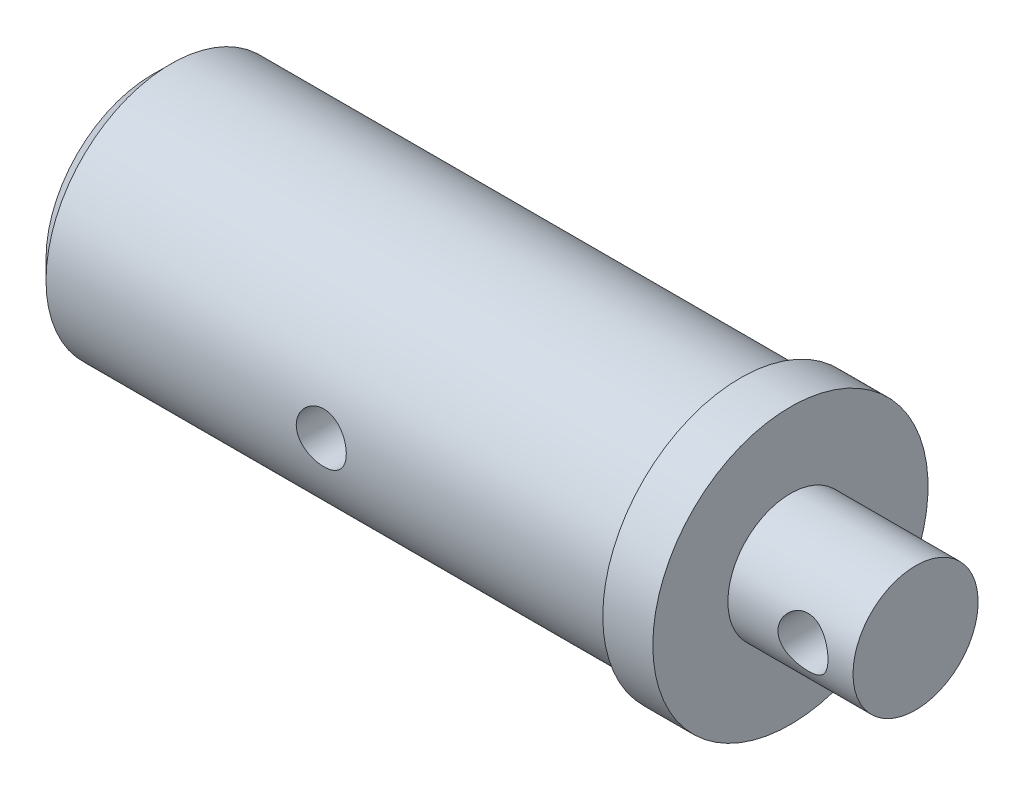
ISO-10303-21;
HEADER;
FILE_DESCRIPTION(('STEP AP214'),'2;1');
FILE_NAME('part.step','',(''),(''),'','','');
FILE_SCHEMA(('AUTOMOTIVE_DESIGN { 1 0 10303 214 1 1 1 1 }'));
ENDSEC;
DATA;
#1=APPLICATION_CONTEXT('core data for automotive mechanical design processes');
#2=APPLICATION_PROTOCOL_DEFINITION('international standard','automotive_design',2000,#1);
#3=PRODUCT_CONTEXT('',#1,'mechanical');
#4=PRODUCT('Part','Part','',(#3));
#5=PRODUCT_RELATED_PRODUCT_CATEGORY('part','',(#4));
#6=PRODUCT_DEFINITION_FORMATION('','',#4);
#7=PRODUCT_DEFINITION_CONTEXT('part definition',#1,'design');
#8=PRODUCT_DEFINITION('design','',#6,#7);
#9=PRODUCT_DEFINITION_SHAPE('','',#8);
#10=(LENGTH_UNIT() NAMED_UNIT(*) SI_UNIT(.MILLI.,.METRE.));
#11=(NAMED_UNIT(*) PLANE_ANGLE_UNIT() SI_UNIT($,.RADIAN.));
#12=(NAMED_UNIT(*) SI_UNIT($,.STERADIAN.) SOLID_ANGLE_UNIT());
#13=UNCERTAINTY_MEASURE_WITH_UNIT(LENGTH_MEASURE(1.E-05),#10,'distance_accuracy_value','');
#14=(GEOMETRIC_REPRESENTATION_CONTEXT(3) GLOBAL_UNCERTAINTY_ASSIGNED_CONTEXT((#13)) GLOBAL_UNIT_ASSIGNED_CONTEXT((#10,
#11,#12)) REPRESENTATION_CONTEXT('',''));
#15=CARTESIAN_POINT('',(0.,0.,0.));
#16=DIRECTION('',(0.,0.,1.));
#17=DIRECTION('',(1.,0.,0.));
#18=AXIS2_PLACEMENT_3D('',#15,#16,#17);
#19=CARTESIAN_POINT('',(-22.,0.,-10.));
#20=DIRECTION('',(1.,0.,0.));
#21=DIRECTION('',(0.,0.,-1.));
#22=AXIS2_PLACEMENT_3D('',#19,#20,#21);
#23=PLANE('',#22);
#24=CARTESIAN_POINT('',(-22.,0.,0.));
#25=DIRECTION('',(1.,0.,0.));
#26=DIRECTION('',(0.,0.,-1.));
#27=AXIS2_PLACEMENT_3D('',#24,#25,#26);
#28=CIRCLE('',#27,8.5);
#29=CARTESIAN_POINT('',(-22.,0.,-8.5));
#30=VERTEX_POINT('',#29);
#31=EDGE_CURVE('E64',#30,#30,#28,.F.);
#32=ORIENTED_EDGE('',*,*,#31,.T.);
#33=EDGE_LOOP('',(#32));
#34=FACE_BOUND('',#33,.T.);
#35=CARTESIAN_POINT('',(-22.,0.,0.));
#36=DIRECTION('',(-1.,0.,0.));
#37=DIRECTION('',(0.,0.,1.));
#38=AXIS2_PLACEMENT_3D('',#35,#36,#37);
#39=CIRCLE('',#38,6.);
#40=CARTESIAN_POINT('',(-22.,0.,6.));
#41=VERTEX_POINT('',#40);
#42=EDGE_CURVE('E144',#41,#41,#39,.T.);
#43=ORIENTED_EDGE('',*,*,#42,.F.);
#44=EDGE_LOOP('',(#43));
#45=FACE_BOUND('',#44,.T.);
#46=ADVANCED_FACE('F51',(#34,#45),#23,.F.);
#47=CARTESIAN_POINT('',(39.,0.,0.));
#48=DIRECTION('',(-1.,0.,0.));
#49=DIRECTION('',(0.,0.,1.));
#50=AXIS2_PLACEMENT_3D('',#47,#48,#49);
#51=PLANE('',#50);
#52=CARTESIAN_POINT('',(39.,0.,0.));
#53=DIRECTION('',(-1.,0.,0.));
#54=DIRECTION('',(0.,0.,1.));
#55=AXIS2_PLACEMENT_3D('',#52,#53,#54);
#56=CIRCLE('',#55,5.);
#57=CARTESIAN_POINT('',(39.,0.,5.));
#58=VERTEX_POINT('',#57);
#59=EDGE_CURVE('E69',#58,#58,#56,.T.);
#60=ORIENTED_EDGE('',*,*,#59,.F.);
#61=EDGE_LOOP('',(#60));
#62=FACE_BOUND('',#61,.T.);
#63=ADVANCED_FACE('F133',(#62),#51,.F.);
#64=CARTESIAN_POINT('',(-22.,0.,0.));
#65=DIRECTION('',(-1.,0.,0.));
#66=DIRECTION('',(0.,0.,1.));
#67=AXIS2_PLACEMENT_3D('',#64,#65,#66);
#68=CYLINDRICAL_SURFACE('',#67,5.);
#69=CARTESIAN_POINT('',(37.,0.,5.));
#70=CARTESIAN_POINT('',(36.9999901481763,-0.107493005442892,4.99999271227085));
#71=CARTESIAN_POINT('',(36.9912822479116,-0.215172564090673,4.99649294306932));
#72=CARTESIAN_POINT('',(36.9567522964788,-0.427496480417896,4.98283453100641));
#73=CARTESIAN_POINT('',(36.9308837209139,-0.532131777561249,4.97265778698877));
#74=CARTESIAN_POINT('',(36.8631239219412,-0.734953922727403,4.94674209213119));
#75=CARTESIAN_POINT('',(36.8212851537833,-0.833160661616958,4.93102136364072));
#76=CARTESIAN_POINT('',(36.7229808266735,-1.02107197032837,4.89556610796078));
#77=CARTESIAN_POINT('',(36.6665203450811,-1.11077947675099,4.87583297458057));
#78=CARTESIAN_POINT('',(36.5377645014391,-1.28350100757039,4.83330886170419));
#79=CARTESIAN_POINT('',(36.4648933437597,-1.36606227255021,4.81042296929191));
#80=CARTESIAN_POINT('',(36.3065999965232,-1.51817500478472,4.76460576906195));
#81=CARTESIAN_POINT('',(36.2211717027883,-1.58772010713353,4.74167444453792));
#82=CARTESIAN_POINT('',(36.0355719297577,-1.71487456729288,4.69722791797136));
#83=CARTESIAN_POINT('',(35.9349135139768,-1.77181498119547,4.67582115964951));
#84=CARTESIAN_POINT('',(35.72446360158,-1.86775471903715,4.63833647186793));
#85=CARTESIAN_POINT('',(35.6146764721516,-1.90676256428584,4.62225601244176));
#86=CARTESIAN_POINT('',(35.3942876664079,-1.96389882339587,4.59826357660818));
#87=CARTESIAN_POINT('',(35.2839487644238,-1.98289396580565,4.59001420355605));
#88=CARTESIAN_POINT('',(35.0613650016927,-2.00217296164003,4.58164004049144));
#89=CARTESIAN_POINT('',(34.949121105375,-2.00246601631323,4.58151125522768));
#90=CARTESIAN_POINT('',(34.734243328542,-1.98498936750455,4.58910500279994));
#91=CARTESIAN_POINT('',(34.631484285591,-1.96847531430514,4.5962817503845));
#92=CARTESIAN_POINT('',(34.4303404439933,-1.91994688029782,4.61676187607836));
#93=CARTESIAN_POINT('',(34.3319564118897,-1.88792979480463,4.63006632321673));
#94=CARTESIAN_POINT('',(34.139982163804,-1.80869473255108,4.6615948508853));
#95=CARTESIAN_POINT('',(34.0465307609453,-1.76117986231532,4.67991379280788));
#96=CARTESIAN_POINT('',(33.8685841836384,-1.65250646073222,4.7193811638989));
#97=CARTESIAN_POINT('',(33.7840923905972,-1.59134280510085,4.74053065456848));
#98=CARTESIAN_POINT('',(33.619590271198,-1.45155059945444,4.78526736742271));
#99=CARTESIAN_POINT('',(33.540431270554,-1.37193746297064,4.80891664976152));
#100=CARTESIAN_POINT('',(33.396315521998,-1.20031442743019,4.85459824958282));
#101=CARTESIAN_POINT('',(33.3313616025897,-1.10830206533444,4.87663024445325));
#102=CARTESIAN_POINT('',(33.2163825525842,-0.912077652605845,4.91714681264548));
#103=CARTESIAN_POINT('',(33.1666777188029,-0.80766049134648,4.93555270095415));
#104=CARTESIAN_POINT('',(33.0858321389219,-0.591023765482884,4.96614828328759));
#105=CARTESIAN_POINT('',(33.0546819624426,-0.478808196849676,4.97834113462382));
#106=CARTESIAN_POINT('',(33.0135517045803,-0.256895887607822,4.99456139506911));
#107=CARTESIAN_POINT('',(33.0024275457464,-0.147443293985536,4.99902945833514));
#108=CARTESIAN_POINT('',(32.9982868994714,0.071845309807816,5.00068478510631));
#109=CARTESIAN_POINT('',(33.0052657184525,0.181681213223923,4.99787393582291));
#110=CARTESIAN_POINT('',(33.036291752552,0.393432739121988,4.98557567063753));
#111=CARTESIAN_POINT('',(33.059557980351,0.495482491775476,4.97639391345523));
#112=CARTESIAN_POINT('',(33.1214357083098,0.694135428060782,4.952594414055));
#113=CARTESIAN_POINT('',(33.1600491796687,0.790737910224845,4.9379759735653));
#114=CARTESIAN_POINT('',(33.2527849396799,0.979078785816701,4.90416594770812));
#115=CARTESIAN_POINT('',(33.3073454720431,1.0705780227554,4.88484815979804));
#116=CARTESIAN_POINT('',(33.4299403239056,1.24344359124655,4.84373364745525));
#117=CARTESIAN_POINT('',(33.4979800429226,1.32480584076112,4.82193593110271));
#118=CARTESIAN_POINT('',(33.6508700129496,1.48072304302882,4.77645117638112));
#119=CARTESIAN_POINT('',(33.7365335415062,1.55447393380607,4.75273441425052));
#120=CARTESIAN_POINT('',(33.9194400830094,1.68675119741371,4.70741672917132));
#121=CARTESIAN_POINT('',(34.0166850003399,1.74527506133751,4.68581615526511));
#122=CARTESIAN_POINT('',(34.2214616945941,1.84580750193163,4.64714299907708));
#123=CARTESIAN_POINT('',(34.3290839992123,1.88765059453446,4.63011630884788));
#124=CARTESIAN_POINT('',(34.5507336517151,1.95229621970531,4.60323673477931));
#125=CARTESIAN_POINT('',(34.6647562058124,1.97511280526932,4.59337855695998));
#126=CARTESIAN_POINT('',(34.8871279017745,1.9997156172784,4.58271759299926));
#127=CARTESIAN_POINT('',(34.9952948395933,2.00289708230287,4.58131421008171));
#128=CARTESIAN_POINT('',(35.2105448577133,1.99180315927753,4.58614836033098));
#129=CARTESIAN_POINT('',(35.3176280739026,1.97752998791379,4.59238492324793));
#130=CARTESIAN_POINT('',(35.523332189855,1.93307136615365,4.61126649079021));
#131=CARTESIAN_POINT('',(35.622120274433,1.90353749357098,4.62364831827449));
#132=CARTESIAN_POINT('',(35.8133786296135,1.83000544849101,4.65324001232697));
#133=CARTESIAN_POINT('',(35.9058471468998,1.78600328139381,4.67045121206007));
#134=CARTESIAN_POINT('',(36.0876096192708,1.68187276275973,4.70898609604491));
#135=CARTESIAN_POINT('',(36.1764186701305,1.62096533515949,4.73048882313242));
#136=CARTESIAN_POINT('',(36.3429933172038,1.4858921192715,4.77463804372237));
#137=CARTESIAN_POINT('',(36.4207555721283,1.41172233481812,4.79728488048406));
#138=CARTESIAN_POINT('',(36.5682028532636,1.24650550627247,4.84293567087394));
#139=CARTESIAN_POINT('',(36.6370373068981,1.15467600114614,4.86586757962185));
#140=CARTESIAN_POINT('',(36.7583370426216,0.95990032028578,4.90800406713717));
#141=CARTESIAN_POINT('',(36.8107947121525,0.856949004547236,4.92720691092906));
#142=CARTESIAN_POINT('',(36.8966222151903,0.6447380624952,4.95939714815861));
#143=CARTESIAN_POINT('',(36.9303293235603,0.535631618219694,4.97249363055028));
#144=CARTESIAN_POINT('',(36.9786391209543,0.312876546281221,4.99144306209366));
#145=CARTESIAN_POINT('',(36.9933024367439,0.199243525858914,4.99731899495638));
#146=CARTESIAN_POINT('',(36.9993953809783,0.0569122978909313,4.99975899504136));
#147=CARTESIAN_POINT('',(37.0000026086292,0.0284626887407592,5.00000192969176));
#148=CARTESIAN_POINT('',(37.,0.,5.));
#149=B_SPLINE_CURVE_WITH_KNOTS('',3,(#69,#70,#71,#72,#73,#74,#75,#76,#77,#78,#79,#80,#81,#82,
#83,#84,#85,#86,#87,#88,#89,#90,#91,#92,#93,#94,#95,#96,#97,#98,#99,#100,#101,#102,#103,#104,
#105,#106,#107,#108,#109,#110,#111,#112,#113,#114,#115,#116,#117,#118,#119,#120,#121,#122,#123,
#124,#125,#126,#127,#128,#129,#130,#131,#132,#133,#134,#135,#136,#137,#138,#139,#140,#141,#142,
#143,#144,#145,#146,#147,#148),.UNSPECIFIED.,.T.,.F.,(4,2,2,2,2,2,2,2,2,2,2,2,2,2,2,2,2,2,2,2,2,
2,2,2,2,2,2,2,2,2,2,2,2,2,2,2,2,2,2,4),(0.,0.322402987893072,0.645683636007934,
0.967911457471579,1.29002753567984,1.62597381700397,1.96208394934411,2.31315258819217,
2.66405423118268,2.99904105308829,3.33386306340489,3.64538328401373,3.95695787256048,
4.27489126298817,4.59294421938184,4.93558349186558,5.27829092839733,5.62776913162807,
5.97706956113791,6.30569184528008,6.63422893570083,6.94800455564367,7.26182048993797,
7.58523513398263,7.9087795949897,8.25368474624414,8.59864669043749,8.94695045140829,
9.29499672645935,9.61799673392749,9.94095572563047,10.2511431854877,10.5614163580516,
10.8894546805669,11.2175920134839,11.5670042353384,11.9165786364054,12.2596430101332,
12.6016125240434,12.686980458968),.UNSPECIFIED.);
#150=CARTESIAN_POINT('',(37.,0.,5.));
#151=VERTEX_POINT('',#150);
#152=EDGE_CURVE('E55',#151,#151,#149,.T.);
#153=ORIENTED_EDGE('',*,*,#152,.T.);
#154=EDGE_LOOP('',(#153));
#155=FACE_BOUND('',#154,.T.);
#156=CARTESIAN_POINT('',(37.,0.,-5.));
#157=CARTESIAN_POINT('',(36.9999901481763,0.107493005442892,-4.99999271227085));
#158=CARTESIAN_POINT('',(36.9912822479116,0.215172564090673,-4.99649294306932));
#159=CARTESIAN_POINT('',(36.9567522964788,0.427496480417896,-4.98283453100641));
#160=CARTESIAN_POINT('',(36.9308837209139,0.532131777561249,-4.97265778698877));
#161=CARTESIAN_POINT('',(36.8631239219412,0.734953922727403,-4.94674209213119));
#162=CARTESIAN_POINT('',(36.8212851537833,0.833160661616958,-4.93102136364072));
#163=CARTESIAN_POINT('',(36.7229808266735,1.02107197032837,-4.89556610796078));
#164=CARTESIAN_POINT('',(36.6665203450811,1.11077947675099,-4.87583297458057));
#165=CARTESIAN_POINT('',(36.5377645014391,1.28350100757039,-4.83330886170419));
#166=CARTESIAN_POINT('',(36.4648933437597,1.36606227255021,-4.81042296929191));
#167=CARTESIAN_POINT('',(36.3065999965232,1.51817500478472,-4.76460576906195));
#168=CARTESIAN_POINT('',(36.2211717027883,1.58772010713353,-4.74167444453792));
#169=CARTESIAN_POINT('',(36.0355719297577,1.71487456729288,-4.69722791797136));
#170=CARTESIAN_POINT('',(35.9349135139768,1.77181498119547,-4.67582115964951));
#171=CARTESIAN_POINT('',(35.72446360158,1.86775471903715,-4.63833647186793));
#172=CARTESIAN_POINT('',(35.6146764721516,1.90676256428584,-4.62225601244176));
#173=CARTESIAN_POINT('',(35.3942876664079,1.96389882339587,-4.59826357660818));
#174=CARTESIAN_POINT('',(35.2839487644238,1.98289396580565,-4.59001420355605));
#175=CARTESIAN_POINT('',(35.0613650016927,2.00217296164003,-4.58164004049144));
#176=CARTESIAN_POINT('',(34.949121105375,2.00246601631323,-4.58151125522768));
#177=CARTESIAN_POINT('',(34.734243328542,1.98498936750455,-4.58910500279994));
#178=CARTESIAN_POINT('',(34.631484285591,1.96847531430514,-4.5962817503845));
#179=CARTESIAN_POINT('',(34.4303404439933,1.91994688029782,-4.61676187607836));
#180=CARTESIAN_POINT('',(34.3319564118897,1.88792979480463,-4.63006632321673));
#181=CARTESIAN_POINT('',(34.139982163804,1.80869473255108,-4.6615948508853));
#182=CARTESIAN_POINT('',(34.0465307609453,1.76117986231532,-4.67991379280788));
#183=CARTESIAN_POINT('',(33.8685841836384,1.65250646073222,-4.7193811638989));
#184=CARTESIAN_POINT('',(33.7840923905972,1.59134280510085,-4.74053065456848));
#185=CARTESIAN_POINT('',(33.619590271198,1.45155059945444,-4.78526736742271));
#186=CARTESIAN_POINT('',(33.540431270554,1.37193746297064,-4.80891664976152));
#187=CARTESIAN_POINT('',(33.396315521998,1.20031442743019,-4.85459824958282));
#188=CARTESIAN_POINT('',(33.3313616025897,1.10830206533444,-4.87663024445325));
#189=CARTESIAN_POINT('',(33.2163825525842,0.912077652605845,-4.91714681264548));
#190=CARTESIAN_POINT('',(33.1666777188029,0.80766049134648,-4.93555270095415));
#191=CARTESIAN_POINT('',(33.0858321389219,0.591023765482884,-4.96614828328759));
#192=CARTESIAN_POINT('',(33.0546819624426,0.478808196849676,-4.97834113462382));
#193=CARTESIAN_POINT('',(33.0135517045803,0.256895887607822,-4.99456139506911));
#194=CARTESIAN_POINT('',(33.0024275457464,0.147443293985536,-4.99902945833514));
#195=CARTESIAN_POINT('',(32.9982868994714,-0.071845309807816,-5.00068478510631));
#196=CARTESIAN_POINT('',(33.0052657184525,-0.181681213223923,-4.99787393582291));
#197=CARTESIAN_POINT('',(33.036291752552,-0.393432739121988,-4.98557567063753));
#198=CARTESIAN_POINT('',(33.059557980351,-0.495482491775476,-4.97639391345523));
#199=CARTESIAN_POINT('',(33.1214357083098,-0.694135428060782,-4.952594414055));
#200=CARTESIAN_POINT('',(33.1600491796687,-0.790737910224845,-4.9379759735653));
#201=CARTESIAN_POINT('',(33.2527849396799,-0.979078785816701,-4.90416594770812));
#202=CARTESIAN_POINT('',(33.3073454720431,-1.0705780227554,-4.88484815979804));
#203=CARTESIAN_POINT('',(33.4299403239056,-1.24344359124655,-4.84373364745525));
#204=CARTESIAN_POINT('',(33.4979800429226,-1.32480584076112,-4.82193593110271));
#205=CARTESIAN_POINT('',(33.6508700129496,-1.48072304302882,-4.77645117638112));
#206=CARTESIAN_POINT('',(33.7365335415062,-1.55447393380607,-4.75273441425052));
#207=CARTESIAN_POINT('',(33.9194400830094,-1.68675119741371,-4.70741672917132));
#208=CARTESIAN_POINT('',(34.0166850003399,-1.74527506133751,-4.68581615526511));
#209=CARTESIAN_POINT('',(34.2214616945941,-1.84580750193163,-4.64714299907708));
#210=CARTESIAN_POINT('',(34.3290839992123,-1.88765059453446,-4.63011630884788));
#211=CARTESIAN_POINT('',(34.5507336517151,-1.95229621970531,-4.60323673477931));
#212=CARTESIAN_POINT('',(34.6647562058124,-1.97511280526932,-4.59337855695998));
#213=CARTESIAN_POINT('',(34.8871279017745,-1.9997156172784,-4.58271759299926));
#214=CARTESIAN_POINT('',(34.9952948395933,-2.00289708230287,-4.58131421008171));
#215=CARTESIAN_POINT('',(35.2105448577133,-1.99180315927753,-4.58614836033098));
#216=CARTESIAN_POINT('',(35.3176280739026,-1.97752998791379,-4.59238492324793));
#217=CARTESIAN_POINT('',(35.523332189855,-1.93307136615365,-4.61126649079021));
#218=CARTESIAN_POINT('',(35.622120274433,-1.90353749357098,-4.62364831827449));
#219=CARTESIAN_POINT('',(35.8133786296135,-1.83000544849101,-4.65324001232697));
#220=CARTESIAN_POINT('',(35.9058471468998,-1.78600328139381,-4.67045121206007));
#221=CARTESIAN_POINT('',(36.0876096192708,-1.68187276275973,-4.70898609604491));
#222=CARTESIAN_POINT('',(36.1764186701305,-1.62096533515949,-4.73048882313242));
#223=CARTESIAN_POINT('',(36.3429933172038,-1.4858921192715,-4.77463804372237));
#224=CARTESIAN_POINT('',(36.4207555721283,-1.41172233481812,-4.79728488048406));
#225=CARTESIAN_POINT('',(36.5682028532636,-1.24650550627247,-4.84293567087394));
#226=CARTESIAN_POINT('',(36.6370373068981,-1.15467600114614,-4.86586757962185));
#227=CARTESIAN_POINT('',(36.7583370426216,-0.95990032028578,-4.90800406713717));
#228=CARTESIAN_POINT('',(36.8107947121525,-0.856949004547236,-4.92720691092906));
#229=CARTESIAN_POINT('',(36.8966222151903,-0.6447380624952,-4.95939714815861));
#230=CARTESIAN_POINT('',(36.9303293235603,-0.535631618219694,-4.97249363055028));
#231=CARTESIAN_POINT('',(36.9786391209543,-0.312876546281221,-4.99144306209366));
#232=CARTESIAN_POINT('',(36.9933024367439,-0.199243525858914,-4.99731899495638));
#233=CARTESIAN_POINT('',(36.9993953809783,-0.0569122978909313,-4.99975899504136));
#234=CARTESIAN_POINT('',(37.0000026086292,-0.0284626887407592,-5.00000192969176));
#235=CARTESIAN_POINT('',(37.,0.,-5.));
#236=B_SPLINE_CURVE_WITH_KNOTS('',3,(#156,#157,#158,#159,#160,#161,#162,#163,#164,#165,#166,
#167,#168,#169,#170,#171,#172,#173,#174,#175,#176,#177,#178,#179,#180,#181,#182,#183,#184,#185,
#186,#187,#188,#189,#190,#191,#192,#193,#194,#195,#196,#197,#198,#199,#200,#201,#202,#203,#204,
#205,#206,#207,#208,#209,#210,#211,#212,#213,#214,#215,#216,#217,#218,#219,#220,#221,#222,#223,
#224,#225,#226,#227,#228,#229,#230,#231,#232,#233,#234,#235),.UNSPECIFIED.,.T.,.F.,(4,2,2,2,2,2,
2,2,2,2,2,2,2,2,2,2,2,2,2,2,2,2,2,2,2,2,2,2,2,2,2,2,2,2,2,2,2,2,2,4),(0.,0.322402987893072,
0.645683636007934,0.967911457471579,1.29002753567984,1.62597381700397,1.96208394934411,
2.31315258819217,2.66405423118268,2.99904105308829,3.33386306340489,3.64538328401373,
3.95695787256048,4.27489126298817,4.59294421938184,4.93558349186558,5.27829092839733,
5.62776913162807,5.97706956113791,6.30569184528008,6.63422893570083,6.94800455564367,
7.26182048993797,7.58523513398263,7.9087795949897,8.25368474624414,8.59864669043749,
8.94695045140829,9.29499672645935,9.61799673392749,9.94095572563047,10.2511431854877,
10.5614163580516,10.8894546805669,11.2175920134839,11.5670042353384,11.9165786364054,
12.2596430101332,12.6016125240434,12.686980458968),.UNSPECIFIED.);
#237=CARTESIAN_POINT('',(37.,0.,-5.));
#238=VERTEX_POINT('',#237);
#239=EDGE_CURVE('E136',#238,#238,#236,.T.);
#240=ORIENTED_EDGE('',*,*,#239,.T.);
#241=EDGE_LOOP('',(#240));
#242=FACE_BOUND('',#241,.T.);
#243=CARTESIAN_POINT('',(29.,0.,0.));
#244=DIRECTION('',(-1.,0.,0.));
#245=DIRECTION('',(0.,0.,1.));
#246=AXIS2_PLACEMENT_3D('',#243,#244,#245);
#247=CIRCLE('',#246,5.);
#248=CARTESIAN_POINT('',(29.,0.,5.));
#249=VERTEX_POINT('',#248);
#250=EDGE_CURVE('E165',#249,#249,#247,.T.);
#251=ORIENTED_EDGE('',*,*,#250,.F.);
#252=EDGE_LOOP('',(#251));
#253=FACE_BOUND('',#252,.T.);
#254=ORIENTED_EDGE('',*,*,#59,.T.);
#255=EDGE_LOOP('',(#254));
#256=FACE_BOUND('',#255,.T.);
#257=ADVANCED_FACE('F128',(#155,#242,#253,#256),#68,.T.);
#258=CARTESIAN_POINT('',(29.,0.,-5.));
#259=DIRECTION('',(-1.,0.,0.));
#260=DIRECTION('',(0.,0.,1.));
#261=AXIS2_PLACEMENT_3D('',#258,#259,#260);
#262=PLANE('',#261);
#263=CARTESIAN_POINT('',(29.,0.,0.));
#264=DIRECTION('',(-1.,0.,0.));
#265=DIRECTION('',(0.,0.,1.));
#266=AXIS2_PLACEMENT_3D('',#263,#264,#265);
#267=CIRCLE('',#266,11.);
#268=CARTESIAN_POINT('',(29.,0.,11.));
#269=VERTEX_POINT('',#268);
#270=EDGE_CURVE('E158',#269,#269,#267,.T.);
#271=ORIENTED_EDGE('',*,*,#270,.F.);
#272=EDGE_LOOP('',(#271));
#273=FACE_BOUND('',#272,.T.);
#274=ORIENTED_EDGE('',*,*,#250,.T.);
#275=EDGE_LOOP('',(#274));
#276=FACE_BOUND('',#275,.T.);
#277=ADVANCED_FACE('F125',(#273,#276),#262,.F.);
#278=CARTESIAN_POINT('',(-22.,0.,0.));
#279=DIRECTION('',(-1.,0.,0.));
#280=DIRECTION('',(0.,0.,1.));
#281=AXIS2_PLACEMENT_3D('',#278,#279,#280);
#282=CYLINDRICAL_SURFACE('',#281,11.);
#283=CARTESIAN_POINT('',(25.,0.,0.));
#284=DIRECTION('',(-1.,0.,0.));
#285=DIRECTION('',(0.,0.,1.));
#286=AXIS2_PLACEMENT_3D('',#283,#284,#285);
#287=CIRCLE('',#286,11.);
#288=CARTESIAN_POINT('',(25.,0.,11.));
#289=VERTEX_POINT('',#288);
#290=EDGE_CURVE('E154',#289,#289,#287,.T.);
#291=ORIENTED_EDGE('',*,*,#290,.F.);
#292=EDGE_LOOP('',(#291));
#293=FACE_BOUND('',#292,.T.);
#294=ORIENTED_EDGE('',*,*,#270,.T.);
#295=EDGE_LOOP('',(#294));
#296=FACE_BOUND('',#295,.T.);
#297=ADVANCED_FACE('F121',(#293,#296),#282,.T.);
#298=CARTESIAN_POINT('',(25.,0.,-11.));
#299=DIRECTION('',(1.,0.,0.));
#300=DIRECTION('',(0.,0.,-1.));
#301=AXIS2_PLACEMENT_3D('',#298,#299,#300);
#302=PLANE('',#301);
#303=CARTESIAN_POINT('',(25.,0.,0.));
#304=DIRECTION('',(-1.,0.,0.));
#305=DIRECTION('',(0.,0.,1.));
#306=AXIS2_PLACEMENT_3D('',#303,#304,#305);
#307=CIRCLE('',#306,10.);
#308=CARTESIAN_POINT('',(25.,0.,10.));
#309=VERTEX_POINT('',#308);
#310=EDGE_CURVE('E153',#309,#309,#307,.T.);
#311=ORIENTED_EDGE('',*,*,#310,.F.);
#312=EDGE_LOOP('',(#311));
#313=FACE_BOUND('',#312,.T.);
#314=ORIENTED_EDGE('',*,*,#290,.T.);
#315=EDGE_LOOP('',(#314));
#316=FACE_BOUND('',#315,.T.);
#317=ADVANCED_FACE('F116',(#313,#316),#302,.F.);
#318=CARTESIAN_POINT('',(-22.,0.,0.));
#319=DIRECTION('',(-1.,0.,0.));
#320=DIRECTION('',(0.,0.,1.));
#321=AXIS2_PLACEMENT_3D('',#318,#319,#320);
#322=CYLINDRICAL_SURFACE('',#321,10.);
#323=CARTESIAN_POINT('',(3.5,0.,10.));
#324=CARTESIAN_POINT('',(3.49999591100331,-0.111153813585266,9.99999795161742));
#325=CARTESIAN_POINT('',(3.49070231406471,-0.222359320403045,9.99812770356462));
#326=CARTESIAN_POINT('',(3.45380299976951,-0.441627015378038,9.99084731246463));
#327=CARTESIAN_POINT('',(3.42618273439698,-0.549686635082711,9.98543435720372));
#328=CARTESIAN_POINT('',(3.35351745275842,-0.759460610526626,9.97167298556574));
#329=CARTESIAN_POINT('',(3.30848912631063,-0.861180935866268,9.96332738153436));
#330=CARTESIAN_POINT('',(3.20233550497741,-1.05561597772845,9.94460796070629));
#331=CARTESIAN_POINT('',(3.14121116878559,-1.14833123015162,9.93423426471414));
#332=CARTESIAN_POINT('',(3.00372301141714,-1.32338695462973,9.9124433065994));
#333=CARTESIAN_POINT('',(2.9271832892176,-1.40558790231705,9.90101491008695));
#334=CARTESIAN_POINT('',(2.7614151672166,-1.55607351321606,9.87848360905177));
#335=CARTESIAN_POINT('',(2.67218577732977,-1.62435708954085,9.86738073000848));
#336=CARTESIAN_POINT('',(2.48256761397625,-1.74566350669524,9.84664883625231));
#337=CARTESIAN_POINT('',(2.38208471240729,-1.79854187773173,9.83703414729892));
#338=CARTESIAN_POINT('',(2.17343636199185,-1.88661133316062,9.82052536116836));
#339=CARTESIAN_POINT('',(2.06527167330732,-1.92180416487448,9.81363099523924));
#340=CARTESIAN_POINT('',(1.84583127218417,-1.97305059976966,9.80345610504409));
#341=CARTESIAN_POINT('',(1.73461491171555,-1.98934899591756,9.80012940214375));
#342=CARTESIAN_POINT('',(1.51098035727132,-2.00310425545224,9.79732750121254));
#343=CARTESIAN_POINT('',(1.39856228735971,-2.000563045427,9.79785190935682));
#344=CARTESIAN_POINT('',(1.177506423958,-1.97690914620364,9.80265102296369));
#345=CARTESIAN_POINT('',(1.06883718874538,-1.95607708048782,9.80686905717527));
#346=CARTESIAN_POINT('',(0.856567846674001,-1.89687576924611,9.81849092320002));
#347=CARTESIAN_POINT('',(0.752967982161989,-1.85850568620137,9.82589490715558));
#348=CARTESIAN_POINT('',(0.552969476592806,-1.76504956734944,9.84311237000816));
#349=CARTESIAN_POINT('',(0.456624240861661,-1.70985230246423,9.85294179627409));
#350=CARTESIAN_POINT('',(0.274458300054377,-1.58438714914536,9.87389237546124));
#351=CARTESIAN_POINT('',(0.188638806297689,-1.51411752871366,9.88501367676732));
#352=CARTESIAN_POINT('',(0.0283411950861314,-1.35899986912117,9.90754042482924));
#353=CARTESIAN_POINT('',(-0.0459051357182569,-1.2739123224249,9.9189473842181));
#354=CARTESIAN_POINT('',(-0.179107692602445,-1.09237004812403,9.94057697428817));
#355=CARTESIAN_POINT('',(-0.238063722587155,-0.995915174758785,9.95079958977947));
#356=CARTESIAN_POINT('',(-0.339055018451947,-0.794118773757848,9.96893380321774));
#357=CARTESIAN_POINT('',(-0.381063787289071,-0.688763639170606,9.97684177696544));
#358=CARTESIAN_POINT('',(-0.446720948077131,-0.472297952897336,9.98942817975717));
#359=CARTESIAN_POINT('',(-0.470371564147254,-0.361188100144906,9.99410700001063));
#360=CARTESIAN_POINT('',(-0.498312907588553,-0.138358811254308,9.99965343733736));
#361=CARTESIAN_POINT('',(-0.502920839080536,-0.0266806566511594,10.0005834930494));
#362=CARTESIAN_POINT('',(-0.493500282115638,0.195849868385421,9.99870103860205));
#363=CARTESIAN_POINT('',(-0.479472841294808,0.30670228488758,9.99588873882892));
#364=CARTESIAN_POINT('',(-0.433443252912088,0.523411319893075,9.98687664016035));
#365=CARTESIAN_POINT('',(-0.401603863004194,0.6293038966798,9.98070752808413));
#366=CARTESIAN_POINT('',(-0.321032034688382,0.834247254999328,9.96567104122066));
#367=CARTESIAN_POINT('',(-0.272298330646341,0.933297523275073,9.95680346428454));
#368=CARTESIAN_POINT('',(-0.158635018697376,1.12308234737243,9.93719823066589));
#369=CARTESIAN_POINT('',(-0.0935144379221105,1.21370025350437,9.92643900874104));
#370=CARTESIAN_POINT('',(0.0508183824145604,1.38283603823841,9.90429469659765));
#371=CARTESIAN_POINT('',(0.130032132799732,1.46135261786152,9.89290953936776));
#372=CARTESIAN_POINT('',(0.301746703782246,1.60528118154835,9.8705860711393));
#373=CARTESIAN_POINT('',(0.394431488442673,1.67047540489731,9.85965720466609));
#374=CARTESIAN_POINT('',(0.589622722713356,1.78437084010241,9.83968383592389));
#375=CARTESIAN_POINT('',(0.692128779147103,1.8330727118458,9.83063925826685));
#376=CARTESIAN_POINT('',(0.903536492299094,1.91230368316392,9.81553481168766));
#377=CARTESIAN_POINT('',(1.01240168242064,1.9429269995821,9.80945949744373));
#378=CARTESIAN_POINT('',(1.23386690698181,1.98541730325439,9.80094873584051));
#379=CARTESIAN_POINT('',(1.34646645241869,1.99728673645022,9.79851281382223));
#380=CARTESIAN_POINT('',(1.57001772908863,2.00184182173493,9.79758299262759));
#381=CARTESIAN_POINT('',(1.68096229785402,1.99487157614179,9.79901838378602));
#382=CARTESIAN_POINT('',(1.90006329981005,1.96270460820012,9.80551146969228));
#383=CARTESIAN_POINT('',(2.00821975538961,1.9375080322586,9.81056913534339));
#384=CARTESIAN_POINT('',(2.21845542248109,1.86975713699791,9.82370528438317));
#385=CARTESIAN_POINT('',(2.32054872100483,1.82724501343469,9.83177642037661));
#386=CARTESIAN_POINT('',(2.51620744146888,1.72610928920321,9.85003429948341));
#387=CARTESIAN_POINT('',(2.60977214745027,1.66748433754976,9.86022121997788));
#388=CARTESIAN_POINT('',(2.78743114430063,1.53461182957283,9.88177921046451));
#389=CARTESIAN_POINT('',(2.87133753053519,1.46011577447036,9.89316745819399));
#390=CARTESIAN_POINT('',(3.02557241105834,1.29812873802628,9.91572163743909));
#391=CARTESIAN_POINT('',(3.09589778063454,1.21063477430667,9.92688751726369));
#392=CARTESIAN_POINT('',(3.22166928789289,1.02403525817649,9.94787664775943));
#393=CARTESIAN_POINT('',(3.27695200656005,0.92481776885967,9.95768462438493));
#394=CARTESIAN_POINT('',(3.36997224519318,0.718332721881466,9.9747025017));
#395=CARTESIAN_POINT('',(3.40772557906498,0.611072521726253,9.98191474277232));
#396=CARTESIAN_POINT('',(3.45730389608943,0.41964297784756,9.99152745190741));
#397=CARTESIAN_POINT('',(3.47328638741552,0.33656332802757,9.99468606316904));
#398=CARTESIAN_POINT('',(3.49463582471673,0.168999050420135,9.99892308279786));
#399=CARTESIAN_POINT('',(3.50000310901954,0.0845144674972385,10.0000015574631));
#400=CARTESIAN_POINT('',(3.5,0.,10.));
#401=B_SPLINE_CURVE_WITH_KNOTS('',3,(#323,#324,#325,#326,#327,#328,#329,#330,#331,#332,#333,
#334,#335,#336,#337,#338,#339,#340,#341,#342,#343,#344,#345,#346,#347,#348,#349,#350,#351,#352,
#353,#354,#355,#356,#357,#358,#359,#360,#361,#362,#363,#364,#365,#366,#367,#368,#369,#370,#371,
#372,#373,#374,#375,#376,#377,#378,#379,#380,#381,#382,#383,#384,#385,#386,#387,#388,#389,#390,
#391,#392,#393,#394,#395,#396,#397,#398,#399,#400),.UNSPECIFIED.,.T.,.F.,(4,2,2,2,2,2,2,2,2,2,2,
2,2,2,2,2,2,2,2,2,2,2,2,2,2,2,2,2,2,2,2,2,2,2,2,2,2,2,4),(0.,0.333152261322517,
0.666569301382646,0.999667470500683,1.33274580446173,1.66986534022437,2.00701119349473,
2.34722390011845,2.68740298730395,3.02312370207175,3.3588100856245,3.68943454012557,
4.02007478507459,4.35294980407185,4.68586309499341,5.02476504982701,5.36367135079641,
5.70310549708048,6.04249851396072,6.3762147135253,6.70991215315735,7.04060907901447,
7.37133078432045,7.70610132066717,8.0409077669186,8.38081257158452,8.72070377446933,
9.05880762065446,9.3968673666083,9.72879445135403,10.0607188698522,10.3918392250622,
10.7229873516373,11.0597615247829,11.3966130906586,11.7369899335127,12.0770591103504,
12.3303755057979,12.5836838274199),.UNSPECIFIED.);
#402=CARTESIAN_POINT('',(3.5,0.,10.));
#403=VERTEX_POINT('',#402);
#404=EDGE_CURVE('E107',#403,#403,#401,.T.);
#405=ORIENTED_EDGE('',*,*,#404,.T.);
#406=EDGE_LOOP('',(#405));
#407=FACE_BOUND('',#406,.T.);
#408=CARTESIAN_POINT('',(3.5,0.,-10.));
#409=CARTESIAN_POINT('',(3.49999591100331,0.111153813585263,-9.99999795161742));
#410=CARTESIAN_POINT('',(3.49070231406471,0.222359320403042,-9.99812770356462));
#411=CARTESIAN_POINT('',(3.45380299976951,0.441627015378036,-9.99084731246463));
#412=CARTESIAN_POINT('',(3.42618273439698,0.549686635082709,-9.98543435720372));
#413=CARTESIAN_POINT('',(3.35351745275842,0.759460610526623,-9.97167298556574));
#414=CARTESIAN_POINT('',(3.30848912631063,0.861180935866265,-9.96332738153436));
#415=CARTESIAN_POINT('',(3.20233550497741,1.05561597772845,-9.94460796070629));
#416=CARTESIAN_POINT('',(3.14121116878559,1.14833123015162,-9.93423426471414));
#417=CARTESIAN_POINT('',(3.00372301141713,1.32338695462973,-9.9124433065994));
#418=CARTESIAN_POINT('',(2.9271832892176,1.40558790231705,-9.90101491008695));
#419=CARTESIAN_POINT('',(2.7614151672166,1.55607351321605,-9.87848360905177));
#420=CARTESIAN_POINT('',(2.67218577732977,1.62435708954085,-9.86738073000848));
#421=CARTESIAN_POINT('',(2.48256761397625,1.74566350669524,-9.84664883625231));
#422=CARTESIAN_POINT('',(2.38208471240728,1.79854187773173,-9.83703414729892));
#423=CARTESIAN_POINT('',(2.17343636199184,1.88661133316061,-9.82052536116836));
#424=CARTESIAN_POINT('',(2.06527167330731,1.92180416487447,-9.81363099523924));
#425=CARTESIAN_POINT('',(1.84583127218417,1.97305059976965,-9.80345610504409));
#426=CARTESIAN_POINT('',(1.73461491171555,1.98934899591755,-9.80012940214376));
#427=CARTESIAN_POINT('',(1.51098035727132,2.00310425545224,-9.79732750121255));
#428=CARTESIAN_POINT('',(1.39856228735971,2.000563045427,-9.79785190935682));
#429=CARTESIAN_POINT('',(1.177506423958,1.97690914620364,-9.80265102296369));
#430=CARTESIAN_POINT('',(1.06883718874537,1.95607708048781,-9.80686905717528));
#431=CARTESIAN_POINT('',(0.856567846673998,1.8968757692461,-9.81849092320003));
#432=CARTESIAN_POINT('',(0.752967982161986,1.85850568620136,-9.82589490715558));
#433=CARTESIAN_POINT('',(0.552969476592803,1.76504956734944,-9.84311237000816));
#434=CARTESIAN_POINT('',(0.456624240861658,1.70985230246423,-9.85294179627409));
#435=CARTESIAN_POINT('',(0.274458300054374,1.58438714914536,-9.87389237546124));
#436=CARTESIAN_POINT('',(0.188638806297687,1.51411752871366,-9.88501367676732));
#437=CARTESIAN_POINT('',(0.0283411950861293,1.35899986912117,-9.90754042482924));
#438=CARTESIAN_POINT('',(-0.0459051357182589,1.27391232242489,-9.9189473842181));
#439=CARTESIAN_POINT('',(-0.179107692602447,1.09237004812402,-9.94057697428817));
#440=CARTESIAN_POINT('',(-0.238063722587157,0.995915174758776,-9.95079958977947));
#441=CARTESIAN_POINT('',(-0.339055018451949,0.794118773757839,-9.96893380321774));
#442=CARTESIAN_POINT('',(-0.381063787289073,0.688763639170597,-9.97684177696544));
#443=CARTESIAN_POINT('',(-0.446720948077132,0.472297952897327,-9.98942817975717));
#444=CARTESIAN_POINT('',(-0.470371564147255,0.361188100144897,-9.99410700001063));
#445=CARTESIAN_POINT('',(-0.498312907588554,0.138358811254299,-9.99965343733736));
#446=CARTESIAN_POINT('',(-0.502920839080536,0.0266806566511501,-10.0005834930494));
#447=CARTESIAN_POINT('',(-0.493500282115637,-0.195849868385431,-9.99870103860205));
#448=CARTESIAN_POINT('',(-0.479472841294808,-0.306702284887589,-9.99588873882892));
#449=CARTESIAN_POINT('',(-0.433443252912087,-0.523411319893084,-9.98687664016035));
#450=CARTESIAN_POINT('',(-0.401603863004193,-0.629303896679809,-9.98070752808413));
#451=CARTESIAN_POINT('',(-0.321032034688381,-0.834247254999337,-9.96567104122065));
#452=CARTESIAN_POINT('',(-0.272298330646339,-0.933297523275082,-9.95680346428454));
#453=CARTESIAN_POINT('',(-0.158635018697374,-1.12308234737244,-9.93719823066589));
#454=CARTESIAN_POINT('',(-0.0935144379221085,-1.21370025350438,-9.92643900874104));
#455=CARTESIAN_POINT('',(0.0508183824145626,-1.38283603823842,-9.90429469659765));
#456=CARTESIAN_POINT('',(0.130032132799734,-1.46135261786153,-9.89290953936776));
#457=CARTESIAN_POINT('',(0.301746703782249,-1.60528118154835,-9.8705860711393));
#458=CARTESIAN_POINT('',(0.394431488442675,-1.67047540489731,-9.85965720466609));
#459=CARTESIAN_POINT('',(0.589622722713359,-1.78437084010241,-9.83968383592389));
#460=CARTESIAN_POINT('',(0.692128779147106,-1.83307271184581,-9.83063925826685));
#461=CARTESIAN_POINT('',(0.903536492299098,-1.91230368316392,-9.81553481168766));
#462=CARTESIAN_POINT('',(1.01240168242064,-1.94292699958211,-9.80945949744373));
#463=CARTESIAN_POINT('',(1.23386690698181,-1.9854173032544,-9.80094873584051));
#464=CARTESIAN_POINT('',(1.3464664524187,-1.99728673645023,-9.79851281382223));
#465=CARTESIAN_POINT('',(1.57001772908864,-2.00184182173494,-9.79758299262758));
#466=CARTESIAN_POINT('',(1.68096229785402,-1.9948715761418,-9.79901838378602));
#467=CARTESIAN_POINT('',(1.90006329981005,-1.96270460820012,-9.80551146969228));
#468=CARTESIAN_POINT('',(2.00821975538961,-1.9375080322586,-9.81056913534338));
#469=CARTESIAN_POINT('',(2.21845542248109,-1.86975713699791,-9.82370528438317));
#470=CARTESIAN_POINT('',(2.32054872100483,-1.82724501343469,-9.83177642037661));
#471=CARTESIAN_POINT('',(2.51620744146888,-1.72610928920321,-9.85003429948341));
#472=CARTESIAN_POINT('',(2.60977214745028,-1.66748433754977,-9.86022121997788));
#473=CARTESIAN_POINT('',(2.78743114430063,-1.53461182957283,-9.88177921046451));
#474=CARTESIAN_POINT('',(2.87133753053519,-1.46011577447036,-9.89316745819399));
#475=CARTESIAN_POINT('',(3.02557241105834,-1.29812873802628,-9.91572163743909));
#476=CARTESIAN_POINT('',(3.09589778063455,-1.21063477430667,-9.92688751726369));
#477=CARTESIAN_POINT('',(3.2216692878929,-1.0240352581765,-9.94787664775943));
#478=CARTESIAN_POINT('',(3.27695200656005,-0.924817768859672,-9.95768462438492));
#479=CARTESIAN_POINT('',(3.36997224519319,-0.718332721881468,-9.9747025017));
#480=CARTESIAN_POINT('',(3.40772557906499,-0.611072521726256,-9.98191474277232));
#481=CARTESIAN_POINT('',(3.45730389608943,-0.419642977847562,-9.99152745190741));
#482=CARTESIAN_POINT('',(3.47328638741552,-0.336563328027572,-9.99468606316904));
#483=CARTESIAN_POINT('',(3.49463582471673,-0.168999050420136,-9.99892308279786));
#484=CARTESIAN_POINT('',(3.50000310901954,-0.0845144674972408,-10.0000015574631));
#485=CARTESIAN_POINT('',(3.5,0.,-10.));
#486=B_SPLINE_CURVE_WITH_KNOTS('',3,(#408,#409,#410,#411,#412,#413,#414,#415,#416,#417,#418,
#419,#420,#421,#422,#423,#424,#425,#426,#427,#428,#429,#430,#431,#432,#433,#434,#435,#436,#437,
#438,#439,#440,#441,#442,#443,#444,#445,#446,#447,#448,#449,#450,#451,#452,#453,#454,#455,#456,
#457,#458,#459,#460,#461,#462,#463,#464,#465,#466,#467,#468,#469,#470,#471,#472,#473,#474,#475,
#476,#477,#478,#479,#480,#481,#482,#483,#484,#485),.UNSPECIFIED.,.T.,.F.,(4,2,2,2,2,2,2,2,2,2,2,
2,2,2,2,2,2,2,2,2,2,2,2,2,2,2,2,2,2,2,2,2,2,2,2,2,2,2,4),(0.,0.333152261322517,
0.666569301382646,0.999667470500683,1.33274580446173,1.66986534022437,2.00701119349473,
2.34722390011845,2.68740298730395,3.02312370207175,3.3588100856245,3.68943454012557,
4.02007478507459,4.35294980407185,4.68586309499341,5.02476504982701,5.3636713507964,
5.70310549708048,6.04249851396072,6.3762147135253,6.70991215315735,7.04060907901447,
7.37133078432045,7.70610132066717,8.0409077669186,8.38081257158452,8.72070377446933,
9.05880762065446,9.3968673666083,9.72879445135403,10.0607188698522,10.3918392250622,
10.7229873516373,11.0597615247829,11.3966130906586,11.7369899335127,12.0770591103504,
12.3303755057979,12.5836838274199),.UNSPECIFIED.);
#487=CARTESIAN_POINT('',(3.5,0.,-10.));
#488=VERTEX_POINT('',#487);
#489=EDGE_CURVE('E102',#488,#488,#486,.T.);
#490=ORIENTED_EDGE('',*,*,#489,.T.);
#491=EDGE_LOOP('',(#490));
#492=FACE_BOUND('',#491,.T.);
#493=CARTESIAN_POINT('',(-20.5,0.,0.));
#494=DIRECTION('',(1.,0.,0.));
#495=DIRECTION('',(0.,0.,-1.));
#496=AXIS2_PLACEMENT_3D('',#493,#494,#495);
#497=CIRCLE('',#496,10.);
#498=CARTESIAN_POINT('',(-20.5,0.,-10.));
#499=VERTEX_POINT('',#498);
#500=EDGE_CURVE('E11',#499,#499,#497,.T.);
#501=ORIENTED_EDGE('',*,*,#500,.T.);
#502=EDGE_LOOP('',(#501));
#503=FACE_BOUND('',#502,.T.);
#504=ORIENTED_EDGE('',*,*,#310,.T.);
#505=EDGE_LOOP('',(#504));
#506=FACE_BOUND('',#505,.T.);
#507=ADVANCED_FACE('F112',(#407,#492,#503,#506),#322,.T.);
#508=CARTESIAN_POINT('',(8.,0.,0.));
#509=DIRECTION('',(-1.,0.,0.));
#510=DIRECTION('',(0.,0.,1.));
#511=AXIS2_PLACEMENT_3D('',#508,#509,#510);
#512=CYLINDRICAL_SURFACE('',#511,6.);
#513=CARTESIAN_POINT('',(3.5,0.,6.));
#514=CARTESIAN_POINT('',(3.50000050746328,0.109126725773446,6.00000030601888));
#515=CARTESIAN_POINT('',(3.49103946774557,0.2182503890771,5.9969953901509));
#516=CARTESIAN_POINT('',(3.45554178236556,0.433283521745944,5.98530420406562));
#517=CARTESIAN_POINT('',(3.42900331210216,0.539192656237635,5.97661734404305));
#518=CARTESIAN_POINT('',(3.3593615132319,0.744665579003552,5.95450615812885));
#519=CARTESIAN_POINT('',(3.31628587508146,0.844239651772068,5.94108975461707));
#520=CARTESIAN_POINT('',(3.21491765432331,1.03474987361065,5.91088891434684));
#521=CARTESIAN_POINT('',(3.1566220699948,1.12568431391741,5.89410381335556));
#522=CARTESIAN_POINT('',(3.02434839028249,1.29948335004453,5.8582818888601));
#523=CARTESIAN_POINT('',(2.94993753147901,1.38200740059662,5.8391911292757));
#524=CARTESIAN_POINT('',(2.78846569058687,1.53366538540417,5.80120629566243));
#525=CARTESIAN_POINT('',(2.70140193014297,1.60279637097892,5.78231226581098));
#526=CARTESIAN_POINT('',(2.51402976960708,1.72764988445572,5.74626664954548));
#527=CARTESIAN_POINT('',(2.41341252053575,1.78292971644206,5.72918078551376));
#528=CARTESIAN_POINT('',(2.20364781108291,1.87563774775544,5.69950610837202));
#529=CARTESIAN_POINT('',(2.09450296567451,1.91307139477353,5.68691592321491));
#530=CARTESIAN_POINT('',(1.87465355700658,1.96774692301833,5.66822606538755));
#531=CARTESIAN_POINT('',(1.76412558302187,1.98562689654354,5.66192191539223));
#532=CARTESIAN_POINT('',(1.54147249168824,2.00268224666895,5.65591313259015));
#533=CARTESIAN_POINT('',(1.42934787858162,2.00186340320943,5.6562064604546));
#534=CARTESIAN_POINT('',(1.21212673911196,1.98203980740683,5.66318030016361));
#535=CARTESIAN_POINT('',(1.10694319416196,1.96386782633399,5.66956831735066));
#536=CARTESIAN_POINT('',(0.901213160786329,1.91121232569883,5.68753315449102));
#537=CARTESIAN_POINT('',(0.800667229129858,1.87672685318374,5.69911059568215));
#538=CARTESIAN_POINT('',(0.605174500817041,1.79187811612042,5.72635822262498));
#539=CARTESIAN_POINT('',(0.510343949060947,1.74126809741452,5.74209131586235));
#540=CARTESIAN_POINT('',(0.330258183440546,1.62577821260627,5.77585117151453));
#541=CARTESIAN_POINT('',(0.245005746133236,1.56089422472801,5.79387859580927));
#542=CARTESIAN_POINT('',(0.081816803678454,1.41469866536447,5.83134658335482));
#543=CARTESIAN_POINT('',(0.00449461098186002,1.33270630015262,5.85081178709686));
#544=CARTESIAN_POINT('',(-0.135462533326796,1.15667913994012,5.88813876774074));
#545=CARTESIAN_POINT('',(-0.198096076328992,1.06264319132162,5.90600039076135));
#546=CARTESIAN_POINT('',(-0.307392600470138,0.86389522609253,5.93834215875587));
#547=CARTESIAN_POINT('',(-0.353890982681464,0.759086552832667,5.95278700016079));
#548=CARTESIAN_POINT('',(-0.428406347911422,0.542538166729009,5.9764113428887));
#549=CARTESIAN_POINT('',(-0.456429750846875,0.430800876309901,5.98559267309759));
#550=CARTESIAN_POINT('',(-0.492111332044717,0.208767659058602,5.99735254142881));
#551=CARTESIAN_POINT('',(-0.500599618345501,0.0986191997296861,6.00020003667456));
#552=CARTESIAN_POINT('',(-0.499334652803061,-0.121550139920481,5.99977805389655));
#553=CARTESIAN_POINT('',(-0.489584480040246,-0.231571038639307,5.99650960838725));
#554=CARTESIAN_POINT('',(-0.45277618452808,-0.445039732608517,5.98440049434209));
#555=CARTESIAN_POINT('',(-0.426227587901009,-0.548585613669693,5.97572397422385));
#556=CARTESIAN_POINT('',(-0.357213111066541,-0.749711917159153,5.9538369366014));
#557=CARTESIAN_POINT('',(-0.314745201064427,-0.847291577017219,5.9406258409335));
#558=CARTESIAN_POINT('',(-0.213859136318425,-1.03657659278655,5.91057862574579));
#559=CARTESIAN_POINT('',(-0.155050813433656,-1.1280599184343,5.89365629511572));
#560=CARTESIAN_POINT('',(-0.0236116999730304,-1.30012966027118,5.85810507832525));
#561=CARTESIAN_POINT('',(0.0490233120635336,-1.38071273559116,5.83947567187655));
#562=CARTESIAN_POINT('',(0.20995750201318,-1.5325050156126,5.80153695960889));
#563=CARTESIAN_POINT('',(0.298818453853726,-1.60312193849155,5.78223522174856));
#564=CARTESIAN_POINT('',(0.487543135621779,-1.72851504464715,5.74599946589417));
#565=CARTESIAN_POINT('',(0.587406957268157,-1.78329109586203,5.72906546764005));
#566=CARTESIAN_POINT('',(0.795346030579796,-1.87519386083273,5.69964783582767));
#567=CARTESIAN_POINT('',(0.903404158337535,-1.91235626433005,5.68715521585958));
#568=CARTESIAN_POINT('',(1.12475730008827,-1.96778933351872,5.66821664612899));
#569=CARTESIAN_POINT('',(1.2380499308087,-1.98606850990788,5.66176797247279));
#570=CARTESIAN_POINT('',(1.46039419208184,-2.00255256495469,5.65595717748354));
#571=CARTESIAN_POINT('',(1.56936468057365,-2.0017405146168,5.6562480051483));
#572=CARTESIAN_POINT('',(1.78553014984413,-1.98248458689739,5.66302539647735));
#573=CARTESIAN_POINT('',(1.89272523591018,-1.96404175891717,5.66951159138723));
#574=CARTESIAN_POINT('',(2.10027132600495,-1.91074362625869,5.68769048609783));
#575=CARTESIAN_POINT('',(2.200713650009,-1.87620669203103,5.69928196044955));
#576=CARTESIAN_POINT('',(2.39445481387654,-1.7919587315195,5.72632797636937));
#577=CARTESIAN_POINT('',(2.48775206237602,-1.74224433710761,5.74178337526786));
#578=CARTESIAN_POINT('',(2.66896733984583,-1.62652138516686,5.77565658452093));
#579=CARTESIAN_POINT('',(2.75647300379678,-1.55989648552916,5.79417423284274));
#580=CARTESIAN_POINT('',(2.91937962676841,-1.4132857662713,5.83166712566506));
#581=CARTESIAN_POINT('',(2.99477715137615,-1.33329616890296,5.85064249824745));
#582=CARTESIAN_POINT('',(3.13428882457836,-1.15848311384138,5.88780061051088));
#583=CARTESIAN_POINT('',(3.197848695502,-1.06320302699946,5.90592363602513));
#584=CARTESIAN_POINT('',(3.3079808577013,-0.862714714813249,5.93851982345224));
#585=CARTESIAN_POINT('',(3.35455749184409,-0.757509036264696,5.9529939181586));
#586=CARTESIAN_POINT('',(3.42744326497735,-0.544987294401951,5.97611030137084));
#587=CARTESIAN_POINT('',(3.45456493252675,-0.437975515352817,5.98498424845045));
#588=CARTESIAN_POINT('',(3.49084056135425,-0.220640832020494,5.99692814128444));
#589=CARTESIAN_POINT('',(3.49999948699308,-0.110318851137493,5.9999996906381));
#590=CARTESIAN_POINT('',(3.5,0.,6.));
#591=B_SPLINE_CURVE_WITH_KNOTS('',3,(#513,#514,#515,#516,#517,#518,#519,#520,#521,#522,#523,
#524,#525,#526,#527,#528,#529,#530,#531,#532,#533,#534,#535,#536,#537,#538,#539,#540,#541,#542,
#543,#544,#545,#546,#547,#548,#549,#550,#551,#552,#553,#554,#555,#556,#557,#558,#559,#560,#561,
#562,#563,#564,#565,#566,#567,#568,#569,#570,#571,#572,#573,#574,#575,#576,#577,#578,#579,#580,
#581,#582,#583,#584,#585,#586,#587,#588,#589,#590),.UNSPECIFIED.,.T.,.F.,(4,2,2,2,2,2,2,2,2,2,2,
2,2,2,2,2,2,2,2,2,2,2,2,2,2,2,2,2,2,2,2,2,2,2,2,2,2,2,4),(0.,0.326974212052022,
0.653982370535041,0.980445345740548,1.3069727555982,1.64369368565512,1.98048866575061,
2.32696769646941,2.67334089385667,3.0080385148368,3.34263267974971,3.66193653102561,
3.98127861710964,4.30576342310261,4.63034205116415,4.97186611622734,5.31342291933237,
5.65836811300715,6.00319337754417,6.33307166350339,6.66289426328353,6.98316315956427,
7.30347290568208,7.63220799687473,7.96104361643783,8.30482045761504,8.64860016469994,
8.99168027653541,9.33460569411681,9.65991332128517,9.98520158702751,10.3043117416084,
10.6234927635196,10.9566013338361,11.2898042224756,11.635993216702,11.9820936230491,
12.3127311674763,12.6432773207628),.UNSPECIFIED.);
#592=CARTESIAN_POINT('',(3.5,0.,6.));
#593=VERTEX_POINT('',#592);
#594=EDGE_CURVE('E81',#593,#593,#591,.T.);
#595=ORIENTED_EDGE('',*,*,#594,.T.);
#596=EDGE_LOOP('',(#595));
#597=FACE_BOUND('',#596,.T.);
#598=CARTESIAN_POINT('',(3.5,0.,-6.));
#599=CARTESIAN_POINT('',(3.50000050746328,-0.109126725773449,-6.00000030601888));
#600=CARTESIAN_POINT('',(3.49103946774557,-0.218250389077103,-5.9969953901509));
#601=CARTESIAN_POINT('',(3.45554178236556,-0.433283521745947,-5.98530420406562));
#602=CARTESIAN_POINT('',(3.42900331210216,-0.539192656237638,-5.97661734404305));
#603=CARTESIAN_POINT('',(3.35936151323191,-0.744665579003555,-5.95450615812885));
#604=CARTESIAN_POINT('',(3.31628587508146,-0.844239651772071,-5.94108975461707));
#605=CARTESIAN_POINT('',(3.21491765432331,-1.03474987361065,-5.91088891434684));
#606=CARTESIAN_POINT('',(3.1566220699948,-1.12568431391741,-5.89410381335556));
#607=CARTESIAN_POINT('',(3.0243483902825,-1.29948335004454,-5.8582818888601));
#608=CARTESIAN_POINT('',(2.94993753147901,-1.38200740059662,-5.8391911292757));
#609=CARTESIAN_POINT('',(2.78846569058687,-1.53366538540417,-5.80120629566243));
#610=CARTESIAN_POINT('',(2.70140193014298,-1.60279637097893,-5.78231226581098));
#611=CARTESIAN_POINT('',(2.51402976960708,-1.72764988445572,-5.74626664954547));
#612=CARTESIAN_POINT('',(2.41341252053576,-1.78292971644207,-5.72918078551376));
#613=CARTESIAN_POINT('',(2.20364781108291,-1.87563774775545,-5.69950610837202));
#614=CARTESIAN_POINT('',(2.09450296567451,-1.91307139477353,-5.68691592321491));
#615=CARTESIAN_POINT('',(1.87465355700658,-1.96774692301833,-5.66822606538754));
#616=CARTESIAN_POINT('',(1.76412558302187,-1.98562689654354,-5.66192191539223));
#617=CARTESIAN_POINT('',(1.54147249168824,-2.00268224666896,-5.65591313259015));
#618=CARTESIAN_POINT('',(1.42934787858162,-2.00186340320944,-5.6562064604546));
#619=CARTESIAN_POINT('',(1.21212673911196,-1.98203980740684,-5.6631803001636));
#620=CARTESIAN_POINT('',(1.10694319416196,-1.96386782633399,-5.66956831735066));
#621=CARTESIAN_POINT('',(0.901213160786333,-1.91121232569884,-5.68753315449102));
#622=CARTESIAN_POINT('',(0.800667229129862,-1.87672685318375,-5.69911059568215));
#623=CARTESIAN_POINT('',(0.605174500817044,-1.79187811612043,-5.72635822262497));
#624=CARTESIAN_POINT('',(0.51034394906095,-1.74126809741453,-5.74209131586235));
#625=CARTESIAN_POINT('',(0.330258183440549,-1.62577821260628,-5.77585117151453));
#626=CARTESIAN_POINT('',(0.245005746133239,-1.56089422472801,-5.79387859580927));
#627=CARTESIAN_POINT('',(0.0818168036784566,-1.41469866536448,-5.83134658335482));
#628=CARTESIAN_POINT('',(0.00449461098186234,-1.33270630015263,-5.85081178709686));
#629=CARTESIAN_POINT('',(-0.135462533326794,-1.15667913994013,-5.88813876774073));
#630=CARTESIAN_POINT('',(-0.19809607632899,-1.06264319132163,-5.90600039076135));
#631=CARTESIAN_POINT('',(-0.307392600470136,-0.863895226092539,-5.93834215875587));
#632=CARTESIAN_POINT('',(-0.353890982681462,-0.759086552832677,-5.95278700016078));
#633=CARTESIAN_POINT('',(-0.42840634791142,-0.542538166729019,-5.9764113428887));
#634=CARTESIAN_POINT('',(-0.456429750846874,-0.430800876309911,-5.98559267309759));
#635=CARTESIAN_POINT('',(-0.492111332044717,-0.208767659058611,-5.99735254142881));
#636=CARTESIAN_POINT('',(-0.500599618345501,-0.0986191997296958,-6.00020003667456));
#637=CARTESIAN_POINT('',(-0.499334652803062,0.121550139920471,-5.99977805389655));
#638=CARTESIAN_POINT('',(-0.489584480040247,0.231571038639297,-5.99650960838725));
#639=CARTESIAN_POINT('',(-0.452776184528081,0.445039732608508,-5.98440049434209));
#640=CARTESIAN_POINT('',(-0.426227587901011,0.548585613669684,-5.97572397422385));
#641=CARTESIAN_POINT('',(-0.357213111066542,0.749711917159144,-5.9538369366014));
#642=CARTESIAN_POINT('',(-0.314745201064428,0.84729157701721,-5.9406258409335));
#643=CARTESIAN_POINT('',(-0.213859136318427,1.03657659278654,-5.9105786257458));
#644=CARTESIAN_POINT('',(-0.155050813433658,1.12805991843429,-5.89365629511572));
#645=CARTESIAN_POINT('',(-0.0236116999730329,1.30012966027117,-5.85810507832525));
#646=CARTESIAN_POINT('',(0.0490233120635308,1.38071273559115,-5.83947567187655));
#647=CARTESIAN_POINT('',(0.209957502013177,1.5325050156126,-5.8015369596089));
#648=CARTESIAN_POINT('',(0.298818453853722,1.60312193849154,-5.78223522174856));
#649=CARTESIAN_POINT('',(0.487543135621775,1.72851504464715,-5.74599946589418));
#650=CARTESIAN_POINT('',(0.587406957268153,1.78329109586202,-5.72906546764005));
#651=CARTESIAN_POINT('',(0.795346030579793,1.87519386083272,-5.69964783582767));
#652=CARTESIAN_POINT('',(0.903404158337533,1.91235626433004,-5.68715521585958));
#653=CARTESIAN_POINT('',(1.12475730008826,1.96778933351871,-5.66821664612899));
#654=CARTESIAN_POINT('',(1.2380499308087,1.98606850990788,-5.66176797247279));
#655=CARTESIAN_POINT('',(1.46039419208183,2.00255256495468,-5.65595717748355));
#656=CARTESIAN_POINT('',(1.56936468057365,2.0017405146168,-5.6562480051483));
#657=CARTESIAN_POINT('',(1.78553014984413,1.98248458689738,-5.66302539647735));
#658=CARTESIAN_POINT('',(1.89272523591018,1.96404175891717,-5.66951159138723));
#659=CARTESIAN_POINT('',(2.10027132600495,1.91074362625869,-5.68769048609783));
#660=CARTESIAN_POINT('',(2.20071365000899,1.87620669203103,-5.69928196044955));
#661=CARTESIAN_POINT('',(2.39445481387654,1.79195873151949,-5.72632797636937));
#662=CARTESIAN_POINT('',(2.48775206237601,1.74224433710761,-5.74178337526786));
#663=CARTESIAN_POINT('',(2.66896733984582,1.62652138516686,-5.77565658452093));
#664=CARTESIAN_POINT('',(2.75647300379677,1.55989648552916,-5.79417423284274));
#665=CARTESIAN_POINT('',(2.9193796267684,1.41328576627129,-5.83166712566506));
#666=CARTESIAN_POINT('',(2.99477715137615,1.33329616890296,-5.85064249824745));
#667=CARTESIAN_POINT('',(3.13428882457836,1.15848311384137,-5.88780061051088));
#668=CARTESIAN_POINT('',(3.197848695502,1.06320302699946,-5.90592363602513));
#669=CARTESIAN_POINT('',(3.3079808577013,0.862714714813247,-5.93851982345224));
#670=CARTESIAN_POINT('',(3.35455749184409,0.757509036264695,-5.9529939181586));
#671=CARTESIAN_POINT('',(3.42744326497735,0.544987294401949,-5.97611030137084));
#672=CARTESIAN_POINT('',(3.45456493252675,0.437975515352815,-5.98498424845045));
#673=CARTESIAN_POINT('',(3.49084056135425,0.220640832020491,-5.99692814128444));
#674=CARTESIAN_POINT('',(3.49999948699308,0.11031885113749,-5.9999996906381));
#675=CARTESIAN_POINT('',(3.5,0.,-6.));
#676=B_SPLINE_CURVE_WITH_KNOTS('',3,(#598,#599,#600,#601,#602,#603,#604,#605,#606,#607,#608,
#609,#610,#611,#612,#613,#614,#615,#616,#617,#618,#619,#620,#621,#622,#623,#624,#625,#626,#627,
#628,#629,#630,#631,#632,#633,#634,#635,#636,#637,#638,#639,#640,#641,#642,#643,#644,#645,#646,
#647,#648,#649,#650,#651,#652,#653,#654,#655,#656,#657,#658,#659,#660,#661,#662,#663,#664,#665,
#666,#667,#668,#669,#670,#671,#672,#673,#674,#675),.UNSPECIFIED.,.T.,.F.,(4,2,2,2,2,2,2,2,2,2,2,
2,2,2,2,2,2,2,2,2,2,2,2,2,2,2,2,2,2,2,2,2,2,2,2,2,2,2,4),(0.,0.326974212052022,
0.653982370535041,0.980445345740547,1.3069727555982,1.64369368565512,1.9804886657506,
2.32696769646941,2.67334089385667,3.0080385148368,3.34263267974971,3.6619365310256,
3.98127861710964,4.30576342310261,4.63034205116414,4.97186611622734,5.31342291933237,
5.65836811300715,6.00319337754417,6.33307166350339,6.66289426328353,6.98316315956427,
7.30347290568208,7.63220799687473,7.96104361643783,8.30482045761504,8.64860016469994,
8.99168027653541,9.33460569411681,9.65991332128517,9.98520158702751,10.3043117416084,
10.6234927635196,10.9566013338361,11.2898042224756,11.635993216702,11.9820936230491,
12.3127311674763,12.6432773207628),.UNSPECIFIED.);
#677=CARTESIAN_POINT('',(3.5,0.,-6.));
#678=VERTEX_POINT('',#677);
#679=EDGE_CURVE('E73',#678,#678,#676,.T.);
#680=ORIENTED_EDGE('',*,*,#679,.T.);
#681=EDGE_LOOP('',(#680));
#682=FACE_BOUND('',#681,.T.);
#683=CARTESIAN_POINT('',(8.,0.,0.));
#684=DIRECTION('',(-1.,0.,0.));
#685=DIRECTION('',(0.,0.,1.));
#686=AXIS2_PLACEMENT_3D('',#683,#684,#685);
#687=CIRCLE('',#686,6.);
#688=CARTESIAN_POINT('',(8.,0.,6.));
#689=VERTEX_POINT('',#688);
#690=EDGE_CURVE('E155',#689,#689,#687,.T.);
#691=ORIENTED_EDGE('',*,*,#690,.F.);
#692=EDGE_LOOP('',(#691));
#693=FACE_BOUND('',#692,.T.);
#694=ORIENTED_EDGE('',*,*,#42,.T.);
#695=EDGE_LOOP('',(#694));
#696=FACE_BOUND('',#695,.T.);
#697=ADVANCED_FACE('F85',(#597,#682,#693,#696),#512,.F.);
#698=CARTESIAN_POINT('',(8.,0.,0.));
#699=DIRECTION('',(-1.,0.,0.));
#700=DIRECTION('',(0.,0.,1.));
#701=AXIS2_PLACEMENT_3D('',#698,#699,#700);
#702=PLANE('',#701);
#703=ORIENTED_EDGE('',*,*,#690,.T.);
#704=EDGE_LOOP('',(#703));
#705=FACE_BOUND('',#704,.T.);
#706=ADVANCED_FACE('F96',(#705),#702,.T.);
#707=CARTESIAN_POINT('',(-22.,0.,0.));
#708=DIRECTION('',(1.,0.,0.));
#709=DIRECTION('',(0.,0.,-1.));
#710=AXIS2_PLACEMENT_3D('',#707,#708,#709);
#711=CONICAL_SURFACE('',#710,8.5,0.785398163397446);
#712=ORIENTED_EDGE('',*,*,#500,.F.);
#713=EDGE_LOOP('',(#712));
#714=FACE_BOUND('',#713,.T.);
#715=ORIENTED_EDGE('',*,*,#31,.F.);
#716=EDGE_LOOP('',(#715));
#717=FACE_BOUND('',#716,.T.);
#718=ADVANCED_FACE('F53',(#714,#717),#711,.T.);
#719=CARTESIAN_POINT('',(1.5,0.,-15.));
#720=DIRECTION('',(0.,0.,1.));
#721=DIRECTION('',(1.,0.,0.));
#722=AXIS2_PLACEMENT_3D('',#719,#720,#721);
#723=CYLINDRICAL_SURFACE('',#722,2.);
#724=ORIENTED_EDGE('',*,*,#679,.F.);
#725=EDGE_LOOP('',(#724));
#726=FACE_BOUND('',#725,.T.);
#727=ORIENTED_EDGE('',*,*,#489,.F.);
#728=EDGE_LOOP('',(#727));
#729=FACE_BOUND('',#728,.T.);
#730=ADVANCED_FACE('F93',(#726,#729),#723,.F.);
#731=ORIENTED_EDGE('',*,*,#594,.F.);
#732=EDGE_LOOP('',(#731));
#733=FACE_BOUND('',#732,.T.);
#734=ORIENTED_EDGE('',*,*,#404,.F.);
#735=EDGE_LOOP('',(#734));
#736=FACE_BOUND('',#735,.T.);
#737=ADVANCED_FACE('F89',(#733,#736),#723,.F.);
#738=CARTESIAN_POINT('',(35.,0.,-15.));
#739=DIRECTION('',(0.,0.,1.));
#740=DIRECTION('',(1.,0.,0.));
#741=AXIS2_PLACEMENT_3D('',#738,#739,#740);
#742=CYLINDRICAL_SURFACE('',#741,2.);
#743=ORIENTED_EDGE('',*,*,#239,.F.);
#744=EDGE_LOOP('',(#743));
#745=FACE_BOUND('',#744,.T.);
#746=ORIENTED_EDGE('',*,*,#152,.F.);
#747=EDGE_LOOP('',(#746));
#748=FACE_BOUND('',#747,.T.);
#749=ADVANCED_FACE('F92',(#745,#748),#742,.F.);
#750=CLOSED_SHELL('',(#46,#63,#257,#277,#297,#317,#507,#697,#706,#718,#730,#737,#749));
#751=MANIFOLD_SOLID_BREP('B2',#750);
#752=ADVANCED_BREP_SHAPE_REPRESENTATION('',(#18,#751),#14);
#753=SHAPE_DEFINITION_REPRESENTATION(#9,#752);
ENDSEC;
END-ISO-10303-21;
